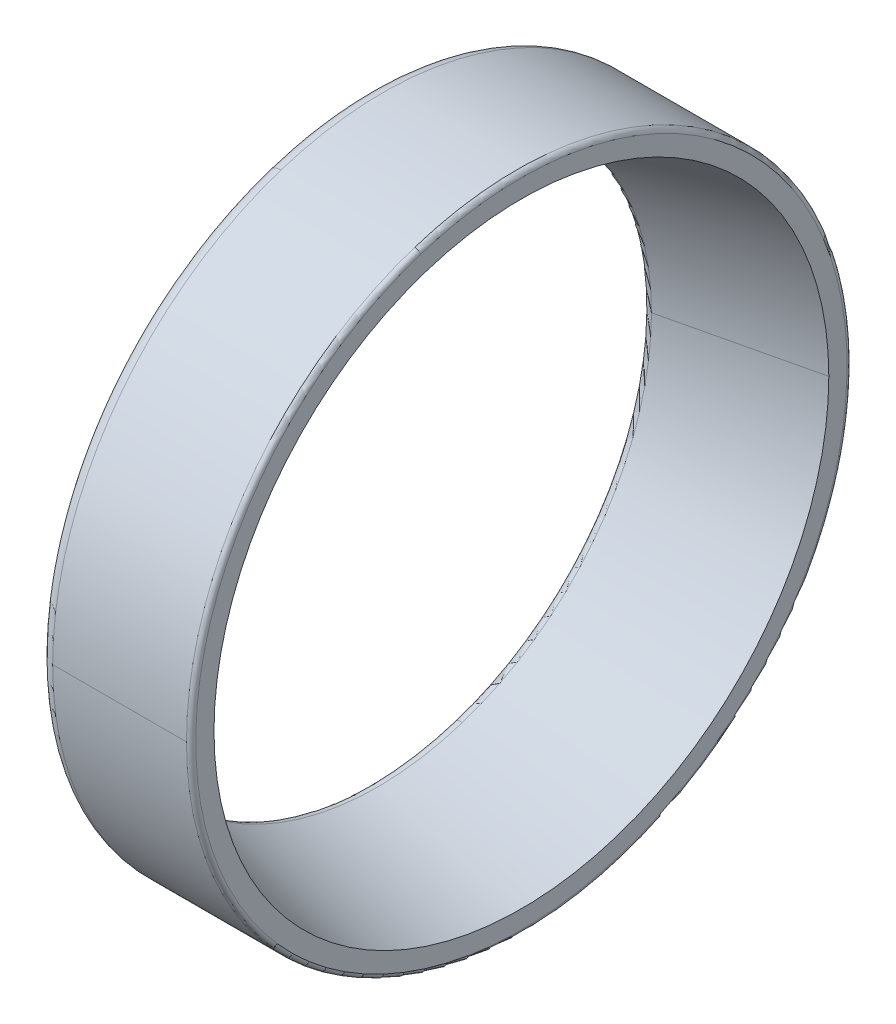
ISO-10303-21;
HEADER;
FILE_DESCRIPTION(('STEP AP214'),'2;1');
FILE_NAME('part.step','',(''),(''),'','','');
FILE_SCHEMA(('AUTOMOTIVE_DESIGN { 1 0 10303 214 1 1 1 1 }'));
ENDSEC;
DATA;
#1=APPLICATION_CONTEXT('core data for automotive mechanical design processes');
#2=APPLICATION_PROTOCOL_DEFINITION('international standard','automotive_design',2000,#1);
#3=PRODUCT_CONTEXT('',#1,'mechanical');
#4=PRODUCT('Part','Part','',(#3));
#5=PRODUCT_RELATED_PRODUCT_CATEGORY('part','',(#4));
#6=PRODUCT_DEFINITION_FORMATION('','',#4);
#7=PRODUCT_DEFINITION_CONTEXT('part definition',#1,'design');
#8=PRODUCT_DEFINITION('design','',#6,#7);
#9=PRODUCT_DEFINITION_SHAPE('','',#8);
#10=(LENGTH_UNIT() NAMED_UNIT(*) SI_UNIT(.MILLI.,.METRE.));
#11=(NAMED_UNIT(*) PLANE_ANGLE_UNIT() SI_UNIT($,.RADIAN.));
#12=(NAMED_UNIT(*) SI_UNIT($,.STERADIAN.) SOLID_ANGLE_UNIT());
#13=UNCERTAINTY_MEASURE_WITH_UNIT(LENGTH_MEASURE(1.E-05),#10,'distance_accuracy_value','');
#14=(GEOMETRIC_REPRESENTATION_CONTEXT(3) GLOBAL_UNCERTAINTY_ASSIGNED_CONTEXT((#13)) GLOBAL_UNIT_ASSIGNED_CONTEXT((#10,
#11,#12)) REPRESENTATION_CONTEXT('',''));
#15=CARTESIAN_POINT('',(0.,0.,0.));
#16=DIRECTION('',(0.,0.,1.));
#17=DIRECTION('',(1.,0.,0.));
#18=AXIS2_PLACEMENT_3D('',#15,#16,#17);
#19=CARTESIAN_POINT('',(0.,29.7,0.));
#20=DIRECTION('',(-1.,0.,0.));
#21=DIRECTION('',(0.,0.,1.));
#22=AXIS2_PLACEMENT_3D('',#19,#20,#21);
#23=PLANE('',#22);
#24=CARTESIAN_POINT('',(0.,0.,0.));
#25=DIRECTION('',(1.,0.,0.));
#26=DIRECTION('',(0.,0.,-1.));
#27=AXIS2_PLACEMENT_3D('',#24,#25,#26);
#28=CIRCLE('',#27,26.331101275992);
#29=CARTESIAN_POINT('',(0.,25.0423654497598,8.13675777488939));
#30=VERTEX_POINT('',#29);
#31=CARTESIAN_POINT('',(0.,-25.0423654497598,-8.13675777488938));
#32=VERTEX_POINT('',#31);
#33=EDGE_CURVE('E11',#30,#32,#28,.T.);
#34=ORIENTED_EDGE('',*,*,#33,.T.);
#35=CARTESIAN_POINT('',(0.,-25.0423654497598,-8.13675777488939));
#36=CARTESIAN_POINT('',(0.,-23.764194615016,-12.0703665351585));
#37=CARTESIAN_POINT('',(0.,-21.7139796229805,-15.753245592985));
#38=CARTESIAN_POINT('',(0.,-18.9560204458166,-18.9822268740673));
#39=CARTESIAN_POINT('',(0.,-12.3226908976115,-24.1846333847985));
#40=CARTESIAN_POINT('',(0.,-4.21487706688132,-26.4932384602298));
#41=CARTESIAN_POINT('',(0.,0.0185317551742482,-26.8264221792779));
#42=CARTESIAN_POINT('',(0.,8.38765826025178,-25.814557743029));
#43=CARTESIAN_POINT('',(0.,15.7531828238797,-21.7139241337033));
#44=CARTESIAN_POINT('',(0.,18.982242028699,-18.9560375702153));
#45=CARTESIAN_POINT('',(0.,24.184637188282,-12.322683432855));
#46=CARTESIAN_POINT('',(0.,26.4932156986311,-4.21487487199578));
#47=CARTESIAN_POINT('',(0.,26.8265039658006,0.018513589680186));
#48=CARTESIAN_POINT('',(0.,26.3204207403123,4.2031114720367));
#49=CARTESIAN_POINT('',(0.,25.0423654497598,8.13675777488938));
#50=B_SPLINE_CURVE_WITH_KNOTS('',5,(#35,#36,#37,#38,#39,#40,#41,#42,#43,#44,#45,#46,#47,#48,
#49),.UNSPECIFIED.,.F.,.F.,(6,3,3,3,6),(0.,0.785398163397448,1.5707963267949,2.35619449019234,
3.14159265358979),.UNSPECIFIED.);
#51=EDGE_CURVE('E26',#32,#30,#50,.T.);
#52=ORIENTED_EDGE('',*,*,#51,.T.);
#53=EDGE_LOOP('',(#34,#52));
#54=FACE_BOUND('',#53,.T.);
#55=CARTESIAN_POINT('',(0.,28.2463785339669,9.17780473293628));
#56=CARTESIAN_POINT('',(0.,28.0962167075424,9.63998867316018));
#57=CARTESIAN_POINT('',(0.,27.9346922822764,10.0984797589242));
#58=CARTESIAN_POINT('',(0.,27.5893497183258,11.0069877771332));
#59=CARTESIAN_POINT('',(0.,27.4055315796412,11.4570047095781));
#60=CARTESIAN_POINT('',(0.,27.0160330731182,12.3474759767493));
#61=CARTESIAN_POINT('',(0.,26.8103527052798,12.7879303114755));
#62=CARTESIAN_POINT('',(0.,26.3776282836223,13.6582164461222));
#63=CARTESIAN_POINT('',(0.,26.1505842298031,14.0880482460426));
#64=CARTESIAN_POINT('',(0.,25.6756785903224,14.9360534988775));
#65=CARTESIAN_POINT('',(0.,25.4278170046608,15.3542269517921));
#66=CARTESIAN_POINT('',(0.,24.9118736401101,16.1779081771358));
#67=CARTESIAN_POINT('',(0.,24.6437918612208,16.5834159495648));
#68=CARTESIAN_POINT('',(0.,24.088053884196,17.3807888879565));
#69=CARTESIAN_POINT('',(0.,23.8003976860604,17.7726540539192));
#70=CARTESIAN_POINT('',(0.,23.2062038751961,18.5417977478289));
#71=CARTESIAN_POINT('',(0.,22.8996662624675,18.9190762757759));
#72=CARTESIAN_POINT('',(0.,22.2684480941755,19.6581377950382));
#73=CARTESIAN_POINT('',(0.,21.9437675386121,20.0199207863534));
#74=CARTESIAN_POINT('',(0.,21.2770456696728,20.7271196658653));
#75=CARTESIAN_POINT('',(0.,20.9350043562971,21.072535554062));
#76=CARTESIAN_POINT('',(0.,20.2343849789148,21.7461680900927));
#77=CARTESIAN_POINT('',(0.,19.8758069149083,22.0743847379267));
#78=CARTESIAN_POINT('',(0.,19.1429778823094,22.7128280906097));
#79=CARTESIAN_POINT('',(0.,18.7687269137169,23.0230547954587));
#80=CARTESIAN_POINT('',(0.,18.0054536752882,23.6247708988589));
#81=CARTESIAN_POINT('',(0.,17.6164314054519,23.9162602974101));
#82=CARTESIAN_POINT('',(0.,16.8245527532639,24.4797995647242));
#83=CARTESIAN_POINT('',(0.,16.421696370912,24.7518494334872));
#84=CARTESIAN_POINT('',(0.,15.6031200100022,25.2758542492617));
#85=CARTESIAN_POINT('',(0.,15.1874000314443,25.5278091962733));
#86=CARTESIAN_POINT('',(0.,14.3440979839641,26.0110171870092));
#87=CARTESIAN_POINT('',(0.,13.9165159150417,26.2422702307335));
#88=CARTESIAN_POINT('',(0.,13.0505197694881,26.6835173060571));
#89=CARTESIAN_POINT('',(0.,12.6121056928569,26.8935113376565));
#90=CARTESIAN_POINT('',(0.,11.7255017097968,27.2917344947147));
#91=CARTESIAN_POINT('',(0.,11.277311803368,27.4799636201736));
#92=CARTESIAN_POINT('',(0.,10.372235889454,27.8342035045009));
#93=CARTESIAN_POINT('',(0.,9.91534988196892,28.0002142633693));
#94=CARTESIAN_POINT('',(0.,8.99398244435297,28.3096174800565));
#95=CARTESIAN_POINT('',(0.,8.52950101422212,28.4530099378754));
#96=CARTESIAN_POINT('',(0.,7.59406170776364,28.716831107473));
#97=CARTESIAN_POINT('',(0.,7.12310383143601,28.8372598192517));
#98=CARTESIAN_POINT('',(0.,6.17584621135907,29.0548633734542));
#99=CARTESIAN_POINT('',(0.,5.69954646760976,29.1520382158779));
#100=CARTESIAN_POINT('',(0.,4.74275256049109,29.3228999286633));
#101=CARTESIAN_POINT('',(0.,4.26225839712173,29.3965867990251));
#102=CARTESIAN_POINT('',(0.,3.29823320328883,29.5202950495616));
#103=CARTESIAN_POINT('',(0.,2.81470217282529,29.5703164297365));
#104=CARTESIAN_POINT('',(0.,1.84576811340873,29.6465731940131));
#105=CARTESIAN_POINT('',(0.,1.36036508445572,29.6728085781148));
#106=CARTESIAN_POINT('',(0.,0.388856406473239,29.701430146907));
#107=CARTESIAN_POINT('',(0.,-0.0972492425562189,29.7038163315974));
#108=CARTESIAN_POINT('',(0.,-1.06899208960524,29.684733753039));
#109=CARTESIAN_POINT('',(0.,-1.5546292876248,29.6632649897901));
#110=CARTESIAN_POINT('',(0.,-2.52426529010721,29.5965242354843));
#111=CARTESIAN_POINT('',(0.,-3.00826409457006,29.5512522444273));
#112=CARTESIAN_POINT('',(0.,-3.9734573144258,29.437014098697));
#113=CARTESIAN_POINT('',(0.,-4.45465172981868,29.3680479440237));
#114=CARTESIAN_POINT('',(0.,-5.41307693204017,29.206587616568));
#115=CARTESIAN_POINT('',(0.,-5.89030771886877,29.1140934437857));
#116=CARTESIAN_POINT('',(0.,-6.83965597319572,28.9057999066758));
#117=CARTESIAN_POINT('',(0.,-7.31177344069407,28.7900005423482));
#118=CARTESIAN_POINT('',(0.,-8.24975768402872,28.5353755929593));
#119=CARTESIAN_POINT('',(0.,-8.71562445986502,28.396550007898));
#120=CARTESIAN_POINT('',(0.,-9.63998500600747,28.0962070600357));
#121=CARTESIAN_POINT('',(0.,-10.0984787763136,27.9346896972347));
#122=CARTESIAN_POINT('',(0.,-11.0069887597438,27.5893523033674));
#123=CARTESIAN_POINT('',(0.,-11.4570049728678,27.405532272301));
#124=CARTESIAN_POINT('',(0.,-12.3474757134595,27.0160323804584));
#125=CARTESIAN_POINT('',(0.,-12.7879302409272,26.8103525196822));
#126=CARTESIAN_POINT('',(0.,-13.6582165166704,26.3776284692199));
#127=CARTESIAN_POINT('',(0.,-14.0880482649459,26.1505842795339));
#128=CARTESIAN_POINT('',(0.,-14.9360534799742,25.6756785405917));
#129=CARTESIAN_POINT('',(0.,-15.354226946727,25.4278169913355));
#130=CARTESIAN_POINT('',(0.,-16.1779081822009,24.9118736534354));
#131=CARTESIAN_POINT('',(0.,-16.583415950922,24.6437918647914));
#132=CARTESIAN_POINT('',(0.,-17.3807888865993,24.0880538806255));
#133=CARTESIAN_POINT('',(0.,-17.7726540535555,23.8003976851037));
#134=CARTESIAN_POINT('',(0.,-18.5417977481925,23.2062038761529));
#135=CARTESIAN_POINT('',(0.,-18.9190762758734,22.8996662627239));
#136=CARTESIAN_POINT('',(0.,-19.6581377949407,22.2684480939192));
#137=CARTESIAN_POINT('',(0.,-20.0199207863273,21.9437675385434));
#138=CARTESIAN_POINT('',(0.,-20.7271196658914,21.2770456697415));
#139=CARTESIAN_POINT('',(0.,-21.072535554069,20.9350043563155));
#140=CARTESIAN_POINT('',(0.,-21.7461680900857,20.2343849788964));
#141=CARTESIAN_POINT('',(0.,-22.0743847379248,19.8758069149034));
#142=CARTESIAN_POINT('',(0.,-22.7128280906116,19.1429778823143));
#143=CARTESIAN_POINT('',(0.,-23.0230547954592,18.7687269137182));
#144=CARTESIAN_POINT('',(0.,-23.6247708988584,18.0054536752869));
#145=CARTESIAN_POINT('',(0.,-23.91626029741,17.6164314054516));
#146=CARTESIAN_POINT('',(0.,-24.4797995647244,16.8245527532642));
#147=CARTESIAN_POINT('',(0.,-24.7518494334872,16.4216963709121));
#148=CARTESIAN_POINT('',(0.,-25.2758542492617,15.6031200100022));
#149=CARTESIAN_POINT('',(0.,-25.5278091962733,15.1874000314444));
#150=CARTESIAN_POINT('',(0.,-26.0110171870092,14.3440979839641));
#151=CARTESIAN_POINT('',(0.,-26.2422702307335,13.9165159150417));
#152=CARTESIAN_POINT('',(0.,-26.6835173060571,13.0505197694881));
#153=CARTESIAN_POINT('',(0.,-26.8935113376564,12.6121056928569));
#154=CARTESIAN_POINT('',(0.,-27.2917344947147,11.7255017097968));
#155=CARTESIAN_POINT('',(0.,-27.4799636201737,11.277311803368));
#156=CARTESIAN_POINT('',(0.,-27.8342035045008,10.3722358894541));
#157=CARTESIAN_POINT('',(0.,-28.0002142633689,9.91534988196904));
#158=CARTESIAN_POINT('',(0.,-28.3096174800568,8.99398244435289));
#159=CARTESIAN_POINT('',(0.,-28.4530099378767,8.52950101422178));
#160=CARTESIAN_POINT('',(0.,-28.7168311074716,7.59406170776404));
#161=CARTESIAN_POINT('',(0.,-28.8372598192466,7.12310383143742));
#162=CARTESIAN_POINT('',(0.,-29.0548633734593,6.17584621135772));
#163=CARTESIAN_POINT('',(0.,-29.1520382158969,5.69954646760464));
#164=CARTESIAN_POINT('',(0.,-29.3228999286443,4.74275256049628));
#165=CARTESIAN_POINT('',(0.,-29.3965867989541,4.262258397141));
#166=CARTESIAN_POINT('',(0.,-29.5202950496325,3.29823320326959));
#167=CARTESIAN_POINT('',(0.,-29.5703164300011,2.81470217275346));
#168=CARTESIAN_POINT('',(0.,-29.6465731937484,1.8457681134806));
#169=CARTESIAN_POINT('',(0.,-29.672808577127,1.36036508472387));
#170=CARTESIAN_POINT('',(0.,-29.7014301478947,0.388856406205133));
#171=CARTESIAN_POINT('',(0.,-29.7038163352837,-0.0972492435568834));
#172=CARTESIAN_POINT('',(0.,-29.6847337493526,-1.06899208860452));
#173=CARTESIAN_POINT('',(0.,-29.6632649760325,-1.55462928389013));
#174=CARTESIAN_POINT('',(0.,-29.5965242492419,-2.52426529384183));
#175=CARTESIAN_POINT('',(0.,-29.5512522957714,-3.0082641085079));
#176=CARTESIAN_POINT('',(0.,-29.4370140473529,-3.97345730048792));
#177=CARTESIAN_POINT('',(0.,-29.3680477524048,-4.45465167780186));
#178=CARTESIAN_POINT('',(0.,-29.2065878081869,-5.41307698405696));
#179=CARTESIAN_POINT('',(0.,-29.1140941589171,-5.89030791299812));
#180=CARTESIAN_POINT('',(0.,-28.9057991915444,-6.83965577906632));
#181=CARTESIAN_POINT('',(0.,-28.7899978734416,-7.31177271619337));
#182=CARTESIAN_POINT('',(0.,-28.535378261866,-8.24975840852937));
#183=CARTESIAN_POINT('',(0.,-28.3965599683932,-8.71562716373832));
#184=CARTESIAN_POINT('',(0.,-28.2463785339669,-9.17780473293622));
#185=B_SPLINE_CURVE_WITH_KNOTS('',3,(#55,#56,#57,#58,#59,#60,#61,#62,#63,#64,#65,#66,#67,#68,
#69,#70,#71,#72,#73,#74,#75,#76,#77,#78,#79,#80,#81,#82,#83,#84,#85,#86,#87,#88,#89,#90,#91,#92,
#93,#94,#95,#96,#97,#98,#99,#100,#101,#102,#103,#104,#105,#106,#107,#108,#109,#110,#111,#112,
#113,#114,#115,#116,#117,#118,#119,#120,#121,#122,#123,#124,#125,#126,#127,#128,#129,#130,#131,
#132,#133,#134,#135,#136,#137,#138,#139,#140,#141,#142,#143,#144,#145,#146,#147,#148,#149,#150,
#151,#152,#153,#154,#155,#156,#157,#158,#159,#160,#161,#162,#163,#164,#165,#166,#167,#168,#169,
#170,#171,#172,#173,#174,#175,#176,#177,#178,#179,#180,#181,#182,#183,#184),.UNSPECIFIED.,.F.,
.F.,(4,2,2,2,2,2,2,2,2,2,2,2,2,2,2,2,2,2,2,2,2,2,2,2,2,2,2,2,2,2,2,2,2,2,2,2,2,2,2,2,2,2,2,2,2,
2,2,2,2,2,2,2,2,2,2,2,2,2,2,2,2,2,2,2,4),(0.,1.45774897426103,2.91549794852206,4.37324692278309,
5.83099589704413,7.28874487130516,8.74649384556619,10.2042428198272,11.6619917940883,
13.1197407683493,14.5774897426103,16.0352387168714,17.4929876911324,18.9507366653934,
20.4084856396544,21.8662346139155,23.3239835881765,24.7817325624375,26.2394815366986,
27.6972305109596,29.1549794852206,30.6127284594816,32.0704774337427,33.5282264080037,
34.9859753822647,36.4437243565258,37.9014733307868,39.3592223050478,40.8169712793089,
42.2747202535699,43.732469227831,45.190218202092,46.647967176353,48.1057161506141,
49.5634651248751,51.0212140991361,52.4789630733971,53.9367120476582,55.3944610219192,
56.8522099961802,58.3099589704413,59.7677079447023,61.2254569189633,62.6832058932244,
64.1409548674854,65.5987038417464,67.0564528160075,68.5142017902685,69.9719507645295,
71.4296997387906,72.8874487130516,74.3451976873126,75.8029466615736,77.2606956358347,
78.7184446100957,80.1761935843568,81.6339425586178,83.0916915328788,84.5494405071398,
86.0071894814009,87.4649384556619,88.9226874299229,90.380436404184,91.838185378445,
93.295934352706),.UNSPECIFIED.);
#186=CARTESIAN_POINT('',(0.,28.2463785339669,9.1778047329362));
#187=VERTEX_POINT('',#186);
#188=CARTESIAN_POINT('',(0.,-28.2463785339669,-9.1778047329362));
#189=VERTEX_POINT('',#188);
#190=EDGE_CURVE('E199',#187,#189,#185,.T.);
#191=ORIENTED_EDGE('',*,*,#190,.F.);
#192=CARTESIAN_POINT('',(0.,-28.2463785339669,-9.17780473293627));
#193=CARTESIAN_POINT('',(0.,-28.0962167075424,-9.63998867316018));
#194=CARTESIAN_POINT('',(0.,-27.9346922822764,-10.0984797589242));
#195=CARTESIAN_POINT('',(0.,-27.5893497183258,-11.0069877771332));
#196=CARTESIAN_POINT('',(0.,-27.4055315796412,-11.4570047095781));
#197=CARTESIAN_POINT('',(0.,-27.0160330731182,-12.3474759767493));
#198=CARTESIAN_POINT('',(0.,-26.8103527052798,-12.7879303114755));
#199=CARTESIAN_POINT('',(0.,-26.3776282836223,-13.6582164461222));
#200=CARTESIAN_POINT('',(0.,-26.1505842298031,-14.0880482460425));
#201=CARTESIAN_POINT('',(0.,-25.6756785903224,-14.9360534988775));
#202=CARTESIAN_POINT('',(0.,-25.4278170046608,-15.3542269517921));
#203=CARTESIAN_POINT('',(0.,-24.9118736401101,-16.1779081771357));
#204=CARTESIAN_POINT('',(0.,-24.6437918612209,-16.5834159495648));
#205=CARTESIAN_POINT('',(0.,-24.088053884196,-17.3807888879565));
#206=CARTESIAN_POINT('',(0.,-23.8003976860604,-17.7726540539192));
#207=CARTESIAN_POINT('',(0.,-23.2062038751961,-18.5417977478289));
#208=CARTESIAN_POINT('',(0.,-22.8996662624676,-18.9190762757759));
#209=CARTESIAN_POINT('',(0.,-22.2684480941755,-19.6581377950382));
#210=CARTESIAN_POINT('',(0.,-21.9437675386121,-20.0199207863534));
#211=CARTESIAN_POINT('',(0.,-21.2770456696728,-20.7271196658653));
#212=CARTESIAN_POINT('',(0.,-20.9350043562971,-21.072535554062));
#213=CARTESIAN_POINT('',(0.,-20.2343849789148,-21.7461680900927));
#214=CARTESIAN_POINT('',(0.,-19.8758069149083,-22.0743847379267));
#215=CARTESIAN_POINT('',(0.,-19.1429778823094,-22.7128280906097));
#216=CARTESIAN_POINT('',(0.,-18.7687269137169,-23.0230547954587));
#217=CARTESIAN_POINT('',(0.,-18.0054536752882,-23.6247708988589));
#218=CARTESIAN_POINT('',(0.,-17.616431405452,-23.9162602974101));
#219=CARTESIAN_POINT('',(0.,-16.8245527532639,-24.4797995647242));
#220=CARTESIAN_POINT('',(0.,-16.421696370912,-24.7518494334872));
#221=CARTESIAN_POINT('',(0.,-15.6031200100023,-25.2758542492617));
#222=CARTESIAN_POINT('',(0.,-15.1874000314444,-25.5278091962733));
#223=CARTESIAN_POINT('',(0.,-14.3440979839641,-26.0110171870092));
#224=CARTESIAN_POINT('',(0.,-13.9165159150417,-26.2422702307335));
#225=CARTESIAN_POINT('',(0.,-13.0505197694881,-26.6835173060571));
#226=CARTESIAN_POINT('',(0.,-12.6121056928569,-26.8935113376564));
#227=CARTESIAN_POINT('',(0.,-11.7255017097968,-27.2917344947147));
#228=CARTESIAN_POINT('',(0.,-11.277311803368,-27.4799636201736));
#229=CARTESIAN_POINT('',(0.,-10.3722358894541,-27.8342035045009));
#230=CARTESIAN_POINT('',(0.,-9.91534988196895,-28.0002142633693));
#231=CARTESIAN_POINT('',(0.,-8.993982444353,-28.3096174800565));
#232=CARTESIAN_POINT('',(0.,-8.52950101422215,-28.4530099378753));
#233=CARTESIAN_POINT('',(0.,-7.59406170776368,-28.716831107473));
#234=CARTESIAN_POINT('',(0.,-7.12310383143604,-28.8372598192517));
#235=CARTESIAN_POINT('',(0.,-6.1758462113591,-29.0548633734542));
#236=CARTESIAN_POINT('',(0.,-5.6995464676098,-29.1520382158779));
#237=CARTESIAN_POINT('',(0.,-4.74275256049113,-29.3228999286633));
#238=CARTESIAN_POINT('',(0.,-4.26225839712177,-29.3965867990251));
#239=CARTESIAN_POINT('',(0.,-3.29823320328887,-29.5202950495616));
#240=CARTESIAN_POINT('',(0.,-2.81470217282533,-29.5703164297365));
#241=CARTESIAN_POINT('',(0.,-1.84576811340877,-29.646573194013));
#242=CARTESIAN_POINT('',(0.,-1.36036508445575,-29.6728085781148));
#243=CARTESIAN_POINT('',(0.,-0.388856406473273,-29.701430146907));
#244=CARTESIAN_POINT('',(0.,0.0972492425561805,-29.7038163315974));
#245=CARTESIAN_POINT('',(0.,1.0689920896052,-29.684733753039));
#246=CARTESIAN_POINT('',(0.,1.55462928762476,-29.6632649897901));
#247=CARTESIAN_POINT('',(0.,2.52426529010717,-29.5965242354843));
#248=CARTESIAN_POINT('',(0.,3.00826409457001,-29.5512522444273));
#249=CARTESIAN_POINT('',(0.,3.97345731442574,-29.437014098697));
#250=CARTESIAN_POINT('',(0.,4.45465172981863,-29.3680479440237));
#251=CARTESIAN_POINT('',(0.,5.41307693204011,-29.206587616568));
#252=CARTESIAN_POINT('',(0.,5.89030771886871,-29.1140934437857));
#253=CARTESIAN_POINT('',(0.,6.83965597319566,-28.9057999066758));
#254=CARTESIAN_POINT('',(0.,7.31177344069402,-28.7900005423482));
#255=CARTESIAN_POINT('',(0.,8.24975768402867,-28.5353755929593));
#256=CARTESIAN_POINT('',(0.,8.71562445986497,-28.396550007898));
#257=CARTESIAN_POINT('',(0.,9.63998500600742,-28.0962070600357));
#258=CARTESIAN_POINT('',(0.,10.0984787763136,-27.9346896972348));
#259=CARTESIAN_POINT('',(0.,11.0069887597437,-27.5893523033674));
#260=CARTESIAN_POINT('',(0.,11.4570049728677,-27.405532272301));
#261=CARTESIAN_POINT('',(0.,12.3474757134595,-27.0160323804584));
#262=CARTESIAN_POINT('',(0.,12.7879302409272,-26.8103525196822));
#263=CARTESIAN_POINT('',(0.,13.6582165166704,-26.3776284692199));
#264=CARTESIAN_POINT('',(0.,14.0880482649458,-26.1505842795339));
#265=CARTESIAN_POINT('',(0.,14.9360534799741,-25.6756785405917));
#266=CARTESIAN_POINT('',(0.,15.3542269467269,-25.4278169913356));
#267=CARTESIAN_POINT('',(0.,16.1779081822008,-24.9118736534354));
#268=CARTESIAN_POINT('',(0.,16.5834159509219,-24.6437918647914));
#269=CARTESIAN_POINT('',(0.,17.3807888865992,-24.0880538806255));
#270=CARTESIAN_POINT('',(0.,17.7726540535554,-23.8003976851037));
#271=CARTESIAN_POINT('',(0.,18.5417977481925,-23.2062038761529));
#272=CARTESIAN_POINT('',(0.,18.9190762758733,-22.8996662627239));
#273=CARTESIAN_POINT('',(0.,19.6581377949407,-22.2684480939192));
#274=CARTESIAN_POINT('',(0.,20.0199207863272,-21.9437675385434));
#275=CARTESIAN_POINT('',(0.,20.7271196658914,-21.2770456697416));
#276=CARTESIAN_POINT('',(0.,21.0725355540689,-20.9350043563155));
#277=CARTESIAN_POINT('',(0.,21.7461680900856,-20.2343849788965));
#278=CARTESIAN_POINT('',(0.,22.0743847379248,-19.8758069149035));
#279=CARTESIAN_POINT('',(0.,22.7128280906115,-19.1429778823144));
#280=CARTESIAN_POINT('',(0.,23.0230547954592,-18.7687269137183));
#281=CARTESIAN_POINT('',(0.,23.6247708988584,-18.0054536752869));
#282=CARTESIAN_POINT('',(0.,23.9162602974099,-17.6164314054517));
#283=CARTESIAN_POINT('',(0.,24.4797995647243,-16.8245527532643));
#284=CARTESIAN_POINT('',(0.,24.7518494334872,-16.4216963709122));
#285=CARTESIAN_POINT('',(0.,25.2758542492616,-15.6031200100022));
#286=CARTESIAN_POINT('',(0.,25.5278091962732,-15.1874000314444));
#287=CARTESIAN_POINT('',(0.,26.0110171870091,-14.3440979839642));
#288=CARTESIAN_POINT('',(0.,26.2422702307334,-13.9165159150418));
#289=CARTESIAN_POINT('',(0.,26.6835173060571,-13.0505197694882));
#290=CARTESIAN_POINT('',(0.,26.8935113376564,-12.612105692857));
#291=CARTESIAN_POINT('',(0.,27.2917344947147,-11.7255017097969));
#292=CARTESIAN_POINT('',(0.,27.4799636201737,-11.277311803368));
#293=CARTESIAN_POINT('',(0.,27.8342035045008,-10.3722358894542));
#294=CARTESIAN_POINT('',(0.,28.0002142633689,-9.91534988196912));
#295=CARTESIAN_POINT('',(0.,28.3096174800568,-8.99398244435297));
#296=CARTESIAN_POINT('',(0.,28.4530099378767,-8.52950101422186));
#297=CARTESIAN_POINT('',(0.,28.7168311074716,-7.59406170776412));
#298=CARTESIAN_POINT('',(0.,28.8372598192466,-7.1231038314375));
#299=CARTESIAN_POINT('',(0.,29.0548633734593,-6.1758462113578));
#300=CARTESIAN_POINT('',(0.,29.1520382158969,-5.69954646760472));
#301=CARTESIAN_POINT('',(0.,29.3228999286443,-4.74275256049637));
#302=CARTESIAN_POINT('',(0.,29.3965867989541,-4.2622583971411));
#303=CARTESIAN_POINT('',(0.,29.5202950496325,-3.2982332032697));
#304=CARTESIAN_POINT('',(0.,29.5703164300011,-2.81470217275357));
#305=CARTESIAN_POINT('',(0.,29.6465731937484,-1.84576811348071));
#306=CARTESIAN_POINT('',(0.,29.672808577127,-1.36036508472398));
#307=CARTESIAN_POINT('',(0.,29.7014301478947,-0.388856406205241));
#308=CARTESIAN_POINT('',(0.,29.7038163352837,0.0972492435567738));
#309=CARTESIAN_POINT('',(0.,29.6847337493526,1.06899208860441));
#310=CARTESIAN_POINT('',(0.,29.6632649760325,1.55462928389003));
#311=CARTESIAN_POINT('',(0.,29.5965242492419,2.52426529384172));
#312=CARTESIAN_POINT('',(0.,29.5512522957714,3.0082641085078));
#313=CARTESIAN_POINT('',(0.,29.4370140473529,3.97345730048781));
#314=CARTESIAN_POINT('',(0.,29.3680477524048,4.45465167780175));
#315=CARTESIAN_POINT('',(0.,29.2065878081869,5.41307698405685));
#316=CARTESIAN_POINT('',(0.,29.1140941589171,5.89030791299801));
#317=CARTESIAN_POINT('',(0.,28.9057991915444,6.83965577906622));
#318=CARTESIAN_POINT('',(0.,28.7899978734416,7.31177271619327));
#319=CARTESIAN_POINT('',(0.,28.535378261866,8.24975840852926));
#320=CARTESIAN_POINT('',(0.,28.3965599683932,8.71562716373821));
#321=CARTESIAN_POINT('',(0.,28.2463785339669,9.17780473293612));
#322=B_SPLINE_CURVE_WITH_KNOTS('',3,(#192,#193,#194,#195,#196,#197,#198,#199,#200,#201,#202,
#203,#204,#205,#206,#207,#208,#209,#210,#211,#212,#213,#214,#215,#216,#217,#218,#219,#220,#221,
#222,#223,#224,#225,#226,#227,#228,#229,#230,#231,#232,#233,#234,#235,#236,#237,#238,#239,#240,
#241,#242,#243,#244,#245,#246,#247,#248,#249,#250,#251,#252,#253,#254,#255,#256,#257,#258,#259,
#260,#261,#262,#263,#264,#265,#266,#267,#268,#269,#270,#271,#272,#273,#274,#275,#276,#277,#278,
#279,#280,#281,#282,#283,#284,#285,#286,#287,#288,#289,#290,#291,#292,#293,#294,#295,#296,#297,
#298,#299,#300,#301,#302,#303,#304,#305,#306,#307,#308,#309,#310,#311,#312,#313,#314,#315,#316,
#317,#318,#319,#320,#321),.UNSPECIFIED.,.F.,.F.,(4,2,2,2,2,2,2,2,2,2,2,2,2,2,2,2,2,2,2,2,2,2,2,
2,2,2,2,2,2,2,2,2,2,2,2,2,2,2,2,2,2,2,2,2,2,2,2,2,2,2,2,2,2,2,2,2,2,2,2,2,2,2,2,2,4),(0.,
1.45774897426103,2.91549794852206,4.37324692278309,5.83099589704412,7.28874487130515,
8.74649384556618,10.2042428198272,11.6619917940882,13.1197407683493,14.5774897426103,
16.0352387168713,17.4929876911323,18.9507366653934,20.4084856396544,21.8662346139154,
23.3239835881765,24.7817325624375,26.2394815366985,27.6972305109596,29.1549794852206,
30.6127284594816,32.0704774337426,33.5282264080037,34.9859753822647,36.4437243565258,
37.9014733307868,39.3592223050478,40.8169712793088,42.2747202535699,43.7324692278309,
45.1902182020919,46.6479671763529,48.105716150614,49.563465124875,51.0212140991361,
52.4789630733971,53.9367120476581,55.3944610219191,56.8522099961802,58.3099589704412,
59.7677079447022,61.2254569189633,62.6832058932243,64.1409548674853,65.5987038417463,
67.0564528160074,68.5142017902684,69.9719507645294,71.4296997387905,72.8874487130515,
74.3451976873125,75.8029466615735,77.2606956358346,78.7184446100956,80.1761935843566,
81.6339425586176,83.0916915328787,84.5494405071397,86.0071894814007,87.4649384556618,
88.9226874299228,90.3804364041839,91.8381853784449,93.2959343527059),.UNSPECIFIED.);
#323=EDGE_CURVE('E301',#189,#187,#322,.T.);
#324=ORIENTED_EDGE('',*,*,#323,.F.);
#325=EDGE_LOOP('',(#191,#324));
#326=FACE_BOUND('',#325,.T.);
#327=ADVANCED_FACE('F17',(#54,#326),#23,.T.);
#328=CARTESIAN_POINT('',(1.29999999999917,0.,0.));
#329=DIRECTION('',(1.,0.,0.));
#330=DIRECTION('',(0.,-0.309016994374947,0.951056516295154));
#331=AXIS2_PLACEMENT_3D('',#328,#329,#330);
#332=TOROIDAL_SURFACE('',#331,29.7000000000009,1.29999999999917);
#333=CARTESIAN_POINT('',(1.29999999999917,-28.2463785339669,-9.1778047329362));
#334=DIRECTION('',(0.,0.309016994374948,-0.951056516295154));
#335=DIRECTION('',(6.41538104691501E-13,-0.951056516295154,-0.309016994374948));
#336=AXIS2_PLACEMENT_3D('',#333,#334,#335);
#337=CIRCLE('',#336,1.29999999999917);
#338=CARTESIAN_POINT('',(1.3,-29.4827520051498,-9.57952682562337));
#339=VERTEX_POINT('',#338);
#340=EDGE_CURVE('E264',#339,#189,#337,.T.);
#341=ORIENTED_EDGE('',*,*,#340,.T.);
#342=ORIENTED_EDGE('',*,*,#323,.T.);
#343=CARTESIAN_POINT('',(1.29999999999917,28.2463785339669,9.1778047329362));
#344=DIRECTION('',(0.,-0.309016994374948,0.951056516295154));
#345=DIRECTION('',(6.43246140114003E-13,0.951056516295154,0.309016994374948));
#346=AXIS2_PLACEMENT_3D('',#343,#344,#345);
#347=CIRCLE('',#346,1.29999999999917);
#348=CARTESIAN_POINT('',(1.3,29.4827520051498,9.57952682562337));
#349=VERTEX_POINT('',#348);
#350=EDGE_CURVE('E260',#349,#187,#347,.T.);
#351=ORIENTED_EDGE('',*,*,#350,.F.);
#352=CARTESIAN_POINT('',(1.3,0.,0.));
#353=DIRECTION('',(1.,0.,0.));
#354=DIRECTION('',(0.,0.,-1.));
#355=AXIS2_PLACEMENT_3D('',#352,#353,#354);
#356=CIRCLE('',#355,31.);
#357=CARTESIAN_POINT('',(1.3,0.,-31.));
#358=VERTEX_POINT('',#357);
#359=EDGE_CURVE('E255',#358,#349,#356,.T.);
#360=ORIENTED_EDGE('',*,*,#359,.F.);
#361=CARTESIAN_POINT('',(1.3,0.,0.));
#362=DIRECTION('',(1.,0.,0.));
#363=DIRECTION('',(0.,0.,-1.));
#364=AXIS2_PLACEMENT_3D('',#361,#362,#363);
#365=CIRCLE('',#364,31.);
#366=EDGE_CURVE('E250',#339,#358,#365,.T.);
#367=ORIENTED_EDGE('',*,*,#366,.F.);
#368=EDGE_LOOP('',(#341,#342,#351,#360,#367));
#369=FACE_BOUND('',#368,.T.);
#370=ADVANCED_FACE('F272',(#369),#332,.T.);
#371=CARTESIAN_POINT('',(14.288,0.,0.));
#372=DIRECTION('',(1.,0.,0.));
#373=DIRECTION('',(0.,1.,0.));
#374=AXIS2_PLACEMENT_3D('',#371,#372,#373);
#375=CYLINDRICAL_SURFACE('',#374,31.);
#376=DIRECTION('',(1.,0.,0.));
#377=VECTOR('',#376,1.);
#378=CARTESIAN_POINT('',(1.3,0.,31.));
#379=LINE('',#378,#377);
#380=CARTESIAN_POINT('',(1.3,0.,31.));
#381=VERTEX_POINT('',#380);
#382=CARTESIAN_POINT('',(13.854666666667,0.,31.));
#383=VERTEX_POINT('',#382);
#384=EDGE_CURVE('E245',#381,#383,#379,.T.);
#385=ORIENTED_EDGE('',*,*,#384,.F.);
#386=CARTESIAN_POINT('',(1.3,0.,0.));
#387=DIRECTION('',(1.,0.,0.));
#388=DIRECTION('',(0.,0.,-1.));
#389=AXIS2_PLACEMENT_3D('',#386,#387,#388);
#390=CIRCLE('',#389,31.);
#391=EDGE_CURVE('E240',#381,#339,#390,.T.);
#392=ORIENTED_EDGE('',*,*,#391,.T.);
#393=ORIENTED_EDGE('',*,*,#366,.T.);
#394=DIRECTION('',(1.,0.,0.));
#395=VECTOR('',#394,1.);
#396=CARTESIAN_POINT('',(1.3,0.,-31.));
#397=LINE('',#396,#395);
#398=CARTESIAN_POINT('',(13.854666666667,0.,-31.));
#399=VERTEX_POINT('',#398);
#400=EDGE_CURVE('E236',#358,#399,#397,.T.);
#401=ORIENTED_EDGE('',*,*,#400,.T.);
#402=CARTESIAN_POINT('',(13.854666666667,0.,0.));
#403=DIRECTION('',(1.,0.,0.));
#404=DIRECTION('',(0.,0.,-1.));
#405=AXIS2_PLACEMENT_3D('',#402,#403,#404);
#406=CIRCLE('',#405,31.);
#407=CARTESIAN_POINT('',(13.854666666667,-29.4827520051498,-9.57952682562337));
#408=VERTEX_POINT('',#407);
#409=EDGE_CURVE('E231',#408,#399,#406,.T.);
#410=ORIENTED_EDGE('',*,*,#409,.F.);
#411=CARTESIAN_POINT('',(13.854666666667,0.,0.));
#412=DIRECTION('',(1.,0.,0.));
#413=DIRECTION('',(0.,0.,-1.));
#414=AXIS2_PLACEMENT_3D('',#411,#412,#413);
#415=CIRCLE('',#414,31.);
#416=EDGE_CURVE('E226',#383,#408,#415,.T.);
#417=ORIENTED_EDGE('',*,*,#416,.F.);
#418=EDGE_LOOP('',(#385,#392,#393,#401,#410,#417));
#419=FACE_BOUND('',#418,.T.);
#420=ADVANCED_FACE('F281',(#419),#375,.T.);
#421=CARTESIAN_POINT('',(13.8546666666672,0.,0.));
#422=DIRECTION('',(1.,0.,0.));
#423=DIRECTION('',(0.,0.309016994374947,-0.951056516295154));
#424=AXIS2_PLACEMENT_3D('',#421,#422,#423);
#425=TOROIDAL_SURFACE('',#424,30.5666666666672,0.433333333332778);
#426=CARTESIAN_POINT('',(13.8546666666672,-29.0706275147557,-9.4456194613944));
#427=DIRECTION('',(0.,0.309016994374947,-0.951056516295154));
#428=DIRECTION('',(1.,0.,0.));
#429=AXIS2_PLACEMENT_3D('',#426,#427,#428);
#430=CIRCLE('',#429,0.433333333332778);
#431=CARTESIAN_POINT('',(14.288,-29.0706275147557,-9.4456194613944));
#432=VERTEX_POINT('',#431);
#433=EDGE_CURVE('E222',#432,#408,#430,.T.);
#434=ORIENTED_EDGE('',*,*,#433,.F.);
#435=CARTESIAN_POINT('',(14.288,0.,0.));
#436=DIRECTION('',(1.,0.,0.));
#437=DIRECTION('',(0.,0.,-1.));
#438=AXIS2_PLACEMENT_3D('',#435,#436,#437);
#439=CIRCLE('',#438,30.566666666667);
#440=CARTESIAN_POINT('',(14.288,29.0706275147557,9.4456194613944));
#441=VERTEX_POINT('',#440);
#442=EDGE_CURVE('E217',#441,#432,#439,.T.);
#443=ORIENTED_EDGE('',*,*,#442,.F.);
#444=CARTESIAN_POINT('',(13.8546666666672,29.0706275147557,9.4456194613944));
#445=DIRECTION('',(0.,-0.309016994374947,0.951056516295154));
#446=DIRECTION('',(1.,0.,0.));
#447=AXIS2_PLACEMENT_3D('',#444,#445,#446);
#448=CIRCLE('',#447,0.433333333332778);
#449=CARTESIAN_POINT('',(13.854666666667,29.4827520051498,9.57952682562338));
#450=VERTEX_POINT('',#449);
#451=EDGE_CURVE('E213',#441,#450,#448,.T.);
#452=ORIENTED_EDGE('',*,*,#451,.T.);
#453=CARTESIAN_POINT('',(13.854666666667,0.,0.));
#454=DIRECTION('',(1.,0.,0.));
#455=DIRECTION('',(0.,0.,-1.));
#456=AXIS2_PLACEMENT_3D('',#453,#454,#455);
#457=CIRCLE('',#456,31.);
#458=EDGE_CURVE('E208',#450,#383,#457,.T.);
#459=ORIENTED_EDGE('',*,*,#458,.T.);
#460=ORIENTED_EDGE('',*,*,#416,.T.);
#461=EDGE_LOOP('',(#434,#443,#452,#459,#460));
#462=FACE_BOUND('',#461,.T.);
#463=ADVANCED_FACE('F285',(#462),#425,.T.);
#464=CARTESIAN_POINT('',(14.288,0.,0.));
#465=DIRECTION('',(1.,0.,0.));
#466=DIRECTION('',(0.,-1.,0.));
#467=AXIS2_PLACEMENT_3D('',#464,#465,#466);
#468=CYLINDRICAL_SURFACE('',#467,31.);
#469=ORIENTED_EDGE('',*,*,#384,.T.);
#470=ORIENTED_EDGE('',*,*,#458,.F.);
#471=CARTESIAN_POINT('',(13.854666666667,0.,0.));
#472=DIRECTION('',(1.,0.,0.));
#473=DIRECTION('',(0.,0.,-1.));
#474=AXIS2_PLACEMENT_3D('',#471,#472,#473);
#475=CIRCLE('',#474,31.);
#476=EDGE_CURVE('E203',#399,#450,#475,.T.);
#477=ORIENTED_EDGE('',*,*,#476,.F.);
#478=ORIENTED_EDGE('',*,*,#400,.F.);
#479=ORIENTED_EDGE('',*,*,#359,.T.);
#480=CARTESIAN_POINT('',(1.3,0.,0.));
#481=DIRECTION('',(1.,0.,0.));
#482=DIRECTION('',(0.,0.,-1.));
#483=AXIS2_PLACEMENT_3D('',#480,#481,#482);
#484=CIRCLE('',#483,31.);
#485=EDGE_CURVE('E200',#349,#381,#484,.T.);
#486=ORIENTED_EDGE('',*,*,#485,.T.);
#487=EDGE_LOOP('',(#469,#470,#477,#478,#479,#486));
#488=FACE_BOUND('',#487,.T.);
#489=ADVANCED_FACE('F288',(#488),#468,.T.);
#490=CARTESIAN_POINT('',(1.29999999999917,0.,0.));
#491=DIRECTION('',(1.,0.,0.));
#492=DIRECTION('',(0.,0.309016994374947,-0.951056516295154));
#493=AXIS2_PLACEMENT_3D('',#490,#491,#492);
#494=TOROIDAL_SURFACE('',#493,29.7000000000009,1.29999999999917);
#495=ORIENTED_EDGE('',*,*,#340,.F.);
#496=ORIENTED_EDGE('',*,*,#391,.F.);
#497=ORIENTED_EDGE('',*,*,#485,.F.);
#498=ORIENTED_EDGE('',*,*,#350,.T.);
#499=ORIENTED_EDGE('',*,*,#190,.T.);
#500=EDGE_LOOP('',(#495,#496,#497,#498,#499));
#501=FACE_BOUND('',#500,.T.);
#502=ADVANCED_FACE('F170',(#501),#494,.T.);
#503=CARTESIAN_POINT('',(13.8546666666672,0.,0.));
#504=DIRECTION('',(1.,0.,0.));
#505=DIRECTION('',(0.,-0.309016994374947,0.951056516295154));
#506=AXIS2_PLACEMENT_3D('',#503,#504,#505);
#507=TOROIDAL_SURFACE('',#506,30.5666666666672,0.433333333332778);
#508=ORIENTED_EDGE('',*,*,#433,.T.);
#509=ORIENTED_EDGE('',*,*,#409,.T.);
#510=ORIENTED_EDGE('',*,*,#476,.T.);
#511=ORIENTED_EDGE('',*,*,#451,.F.);
#512=CARTESIAN_POINT('',(14.288,-29.0706275147555,-9.44561946139432));
#513=CARTESIAN_POINT('',(14.288,-27.5868528165702,-14.0119802266334));
#514=CARTESIAN_POINT('',(14.288,-25.206844567022,-18.2872794385533));
#515=CARTESIAN_POINT('',(14.288,-22.0052458961183,-22.03566783512));
#516=CARTESIAN_POINT('',(14.288,-14.3048929536076,-28.074922479703));
#517=CARTESIAN_POINT('',(14.288,-4.89287329815587,-30.7548848962397));
#518=CARTESIAN_POINT('',(14.288,0.0215127342081851,-31.1416638452915));
#519=CARTESIAN_POINT('',(14.288,9.73687926941345,-29.9670330309369));
#520=CARTESIAN_POINT('',(14.288,18.2872065725422,-25.2067801518568));
#521=CARTESIAN_POINT('',(14.288,22.0356854274937,-22.0052657751117));
#522=CARTESIAN_POINT('',(14.288,28.0749268950068,-14.3048842880859));
#523=CARTESIAN_POINT('',(14.288,30.7548584732583,-4.89287075020571));
#524=CARTESIAN_POINT('',(14.288,31.1417587878217,0.0214916466510857));
#525=CARTESIAN_POINT('',(14.288,30.5542680825545,4.87921511455088));
#526=CARTESIAN_POINT('',(14.288,29.0706275147555,9.44561946139432));
#527=B_SPLINE_CURVE_WITH_KNOTS('',5,(#512,#513,#514,#515,#516,#517,#518,#519,#520,#521,#522,
#523,#524,#525,#526),.UNSPECIFIED.,.F.,.F.,(6,3,3,3,6),(0.,0.785398163397448,1.5707963267949,
2.35619449019234,3.14159265358979),.UNSPECIFIED.);
#528=EDGE_CURVE('E144',#432,#441,#527,.T.);
#529=ORIENTED_EDGE('',*,*,#528,.F.);
#530=EDGE_LOOP('',(#508,#509,#510,#511,#529));
#531=FACE_BOUND('',#530,.T.);
#532=ADVANCED_FACE('F164',(#531),#507,.T.);
#533=CARTESIAN_POINT('',(14.288,28.849808331477,0.));
#534=DIRECTION('',(1.,0.,0.));
#535=DIRECTION('',(0.,0.,-1.));
#536=AXIS2_PLACEMENT_3D('',#533,#534,#535);
#537=PLANE('',#536);
#538=ORIENTED_EDGE('',*,*,#442,.T.);
#539=ORIENTED_EDGE('',*,*,#528,.T.);
#540=EDGE_LOOP('',(#538,#539));
#541=FACE_BOUND('',#540,.T.);
#542=CARTESIAN_POINT('',(14.288,0.,0.));
#543=DIRECTION('',(1.,0.,0.));
#544=DIRECTION('',(0.,0.,-1.));
#545=AXIS2_PLACEMENT_3D('',#542,#543,#544);
#546=CIRCLE('',#545,28.849808331477);
#547=CARTESIAN_POINT('',(14.288,0.,28.849808331477));
#548=VERTEX_POINT('',#547);
#549=CARTESIAN_POINT('',(14.288,0.,-28.849808331477));
#550=VERTEX_POINT('',#549);
#551=EDGE_CURVE('E140',#548,#550,#546,.T.);
#552=ORIENTED_EDGE('',*,*,#551,.F.);
#553=CARTESIAN_POINT('',(14.288,0.,0.));
#554=DIRECTION('',(1.,0.,0.));
#555=DIRECTION('',(0.,0.,-1.));
#556=AXIS2_PLACEMENT_3D('',#553,#554,#555);
#557=CIRCLE('',#556,28.849808331477);
#558=EDGE_CURVE('E135',#550,#548,#557,.T.);
#559=ORIENTED_EDGE('',*,*,#558,.F.);
#560=EDGE_LOOP('',(#552,#559));
#561=FACE_BOUND('',#560,.T.);
#562=ADVANCED_FACE('F153',(#541,#561),#537,.T.);
#563=CARTESIAN_POINT('',(0.79787576400985,0.,0.));
#564=DIRECTION('',(1.,0.,0.));
#565=DIRECTION('',(0.,-1.,0.));
#566=AXIS2_PLACEMENT_3D('',#563,#564,#565);
#567=CONICAL_SURFACE('',#566,25.698145702181,0.229510796637261);
#568=DIRECTION('',(0.973777805863184,0.,0.227501175399783));
#569=VECTOR('',#568,1.);
#570=CARTESIAN_POINT('',(0.797875764009836,0.,25.698145702181));
#571=LINE('',#570,#569);
#572=CARTESIAN_POINT('',(0.797875764009836,0.,25.698145702181));
#573=VERTEX_POINT('',#572);
#574=EDGE_CURVE('E131',#573,#548,#571,.T.);
#575=ORIENTED_EDGE('',*,*,#574,.F.);
#576=CARTESIAN_POINT('',(0.79787576400985,0.,0.));
#577=DIRECTION('',(1.,0.,0.));
#578=DIRECTION('',(0.,0.,-1.));
#579=AXIS2_PLACEMENT_3D('',#576,#577,#578);
#580=CIRCLE('',#579,25.698145702181);
#581=CARTESIAN_POINT('',(0.797875764009854,24.4403889267615,7.94116374589744));
#582=VERTEX_POINT('',#581);
#583=EDGE_CURVE('E114',#582,#573,#580,.T.);
#584=ORIENTED_EDGE('',*,*,#583,.F.);
#585=CARTESIAN_POINT('',(0.79787576400985,0.,0.));
#586=DIRECTION('',(1.,0.,0.));
#587=DIRECTION('',(0.,0.,-1.));
#588=AXIS2_PLACEMENT_3D('',#585,#586,#587);
#589=CIRCLE('',#588,25.698145702181);
#590=CARTESIAN_POINT('',(0.79787576400985,0.,-25.698145702181));
#591=VERTEX_POINT('',#590);
#592=EDGE_CURVE('E124',#591,#582,#589,.T.);
#593=ORIENTED_EDGE('',*,*,#592,.F.);
#594=DIRECTION('',(0.973777805863184,0.,-0.227501175399783));
#595=VECTOR('',#594,1.);
#596=CARTESIAN_POINT('',(0.797875764009836,0.,-25.698145702181));
#597=LINE('',#596,#595);
#598=EDGE_CURVE('E102',#591,#550,#597,.T.);
#599=ORIENTED_EDGE('',*,*,#598,.T.);
#600=ORIENTED_EDGE('',*,*,#558,.T.);
#601=EDGE_LOOP('',(#575,#584,#593,#599,#600));
#602=FACE_BOUND('',#601,.T.);
#603=ADVANCED_FACE('F163',(#602),#567,.F.);
#604=CARTESIAN_POINT('',(0.79787576400985,0.,0.));
#605=DIRECTION('',(1.,0.,0.));
#606=DIRECTION('',(0.,1.,0.));
#607=AXIS2_PLACEMENT_3D('',#604,#605,#606);
#608=CONICAL_SURFACE('',#607,25.698145702181,0.229510796637261);
#609=ORIENTED_EDGE('',*,*,#574,.T.);
#610=ORIENTED_EDGE('',*,*,#551,.T.);
#611=ORIENTED_EDGE('',*,*,#598,.F.);
#612=CARTESIAN_POINT('',(0.79787576400985,0.,0.));
#613=DIRECTION('',(1.,0.,0.));
#614=DIRECTION('',(0.,0.,-1.));
#615=AXIS2_PLACEMENT_3D('',#612,#613,#614);
#616=CIRCLE('',#615,25.698145702181);
#617=CARTESIAN_POINT('',(0.797875764009854,-24.4403889267615,-7.94116374589744));
#618=VERTEX_POINT('',#617);
#619=EDGE_CURVE('E93',#618,#591,#616,.T.);
#620=ORIENTED_EDGE('',*,*,#619,.F.);
#621=CARTESIAN_POINT('',(0.79787576400985,0.,0.));
#622=DIRECTION('',(1.,0.,0.));
#623=DIRECTION('',(0.,0.,-1.));
#624=AXIS2_PLACEMENT_3D('',#621,#622,#623);
#625=CIRCLE('',#624,25.698145702181);
#626=EDGE_CURVE('E98',#573,#618,#625,.T.);
#627=ORIENTED_EDGE('',*,*,#626,.F.);
#628=EDGE_LOOP('',(#609,#610,#611,#620,#627));
#629=FACE_BOUND('',#628,.T.);
#630=ADVANCED_FACE('F96',(#629),#608,.F.);
#631=CARTESIAN_POINT('',(0.649999999999953,0.,0.));
#632=DIRECTION('',(1.,0.,0.));
#633=DIRECTION('',(0.,0.309016994374947,-0.951056516295154));
#634=AXIS2_PLACEMENT_3D('',#631,#632,#633);
#635=TOROIDAL_SURFACE('',#634,26.331101275992,0.649999999999953);
#636=CARTESIAN_POINT('',(0.649999999999953,-25.0423654497598,-8.13675777488938));
#637=DIRECTION('',(0.,0.309016994374947,-0.951056516295154));
#638=DIRECTION('',(-1.,0.,0.));
#639=AXIS2_PLACEMENT_3D('',#636,#637,#638);
#640=CIRCLE('',#639,0.649999999999953);
#641=EDGE_CURVE('E106',#32,#618,#640,.T.);
#642=ORIENTED_EDGE('',*,*,#641,.F.);
#643=ORIENTED_EDGE('',*,*,#33,.F.);
#644=CARTESIAN_POINT('',(0.649999999999953,25.0423654497598,8.13675777488939));
#645=DIRECTION('',(0.,-0.309016994374947,0.951056516295154));
#646=DIRECTION('',(-1.,0.,0.));
#647=AXIS2_PLACEMENT_3D('',#644,#645,#646);
#648=CIRCLE('',#647,0.649999999999953);
#649=EDGE_CURVE('E110',#30,#582,#648,.T.);
#650=ORIENTED_EDGE('',*,*,#649,.T.);
#651=ORIENTED_EDGE('',*,*,#583,.T.);
#652=ORIENTED_EDGE('',*,*,#626,.T.);
#653=EDGE_LOOP('',(#642,#643,#650,#651,#652));
#654=FACE_BOUND('',#653,.T.);
#655=ADVANCED_FACE('F112',(#654),#635,.T.);
#656=CARTESIAN_POINT('',(0.649999999999953,0.,0.));
#657=DIRECTION('',(1.,0.,0.));
#658=DIRECTION('',(0.,-0.309016994374947,0.951056516295154));
#659=AXIS2_PLACEMENT_3D('',#656,#657,#658);
#660=TOROIDAL_SURFACE('',#659,26.331101275992,0.649999999999953);
#661=ORIENTED_EDGE('',*,*,#641,.T.);
#662=ORIENTED_EDGE('',*,*,#619,.T.);
#663=ORIENTED_EDGE('',*,*,#592,.T.);
#664=ORIENTED_EDGE('',*,*,#649,.F.);
#665=ORIENTED_EDGE('',*,*,#51,.F.);
#666=EDGE_LOOP('',(#661,#662,#663,#664,#665));
#667=FACE_BOUND('',#666,.T.);
#668=ADVANCED_FACE('F107',(#667),#660,.T.);
#669=CLOSED_SHELL('',(#327,#370,#420,#463,#489,#502,#532,#562,#603,#630,#655,#668));
#670=MANIFOLD_SOLID_BREP('B1',#669);
#671=ADVANCED_BREP_SHAPE_REPRESENTATION('',(#18,#670),#14);
#672=SHAPE_DEFINITION_REPRESENTATION(#9,#671);
ENDSEC;
END-ISO-10303-21;
